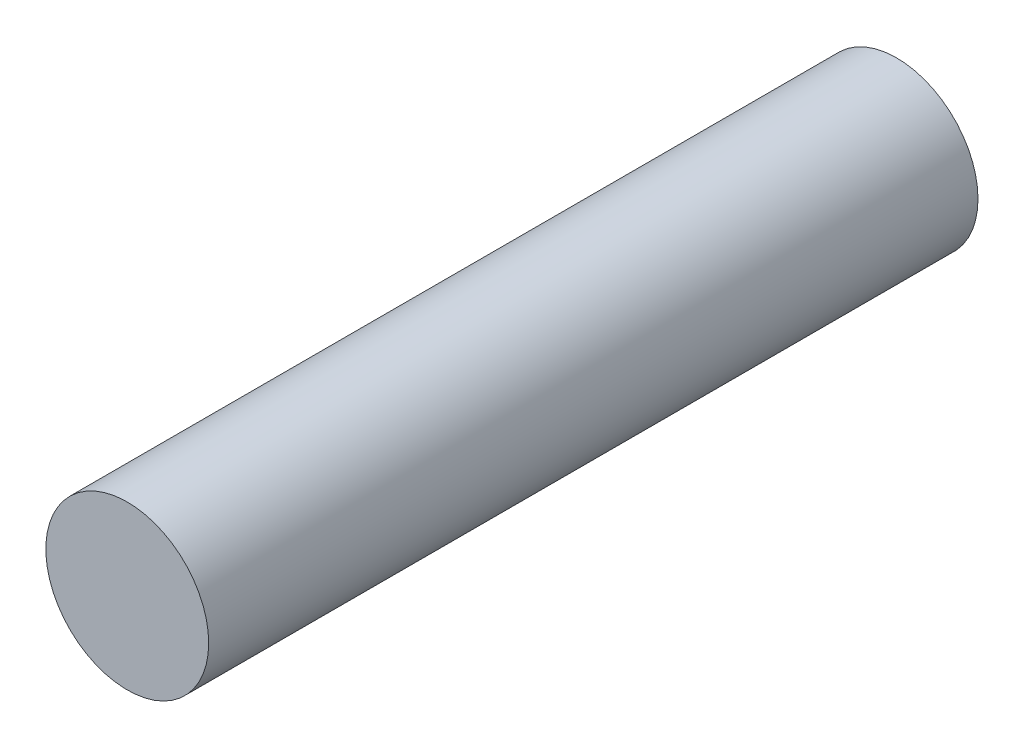
ISO-10303-21;
HEADER;
FILE_DESCRIPTION(('STEP AP214'),'2;1');
FILE_NAME('part.step','',(''),(''),'','','');
FILE_SCHEMA(('AUTOMOTIVE_DESIGN { 1 0 10303 214 1 1 1 1 }'));
ENDSEC;
DATA;
#1=APPLICATION_CONTEXT('core data for automotive mechanical design processes');
#2=APPLICATION_PROTOCOL_DEFINITION('international standard','automotive_design',2000,#1);
#3=PRODUCT_CONTEXT('',#1,'mechanical');
#4=PRODUCT('Part','Part','',(#3));
#5=PRODUCT_RELATED_PRODUCT_CATEGORY('part','',(#4));
#6=PRODUCT_DEFINITION_FORMATION('','',#4);
#7=PRODUCT_DEFINITION_CONTEXT('part definition',#1,'design');
#8=PRODUCT_DEFINITION('design','',#6,#7);
#9=PRODUCT_DEFINITION_SHAPE('','',#8);
#10=(LENGTH_UNIT() NAMED_UNIT(*) SI_UNIT(.MILLI.,.METRE.));
#11=(NAMED_UNIT(*) PLANE_ANGLE_UNIT() SI_UNIT($,.RADIAN.));
#12=(NAMED_UNIT(*) SI_UNIT($,.STERADIAN.) SOLID_ANGLE_UNIT());
#13=UNCERTAINTY_MEASURE_WITH_UNIT(LENGTH_MEASURE(1.E-05),#10,'distance_accuracy_value','');
#14=(GEOMETRIC_REPRESENTATION_CONTEXT(3) GLOBAL_UNCERTAINTY_ASSIGNED_CONTEXT((#13)) GLOBAL_UNIT_ASSIGNED_CONTEXT((#10,
#11,#12)) REPRESENTATION_CONTEXT('',''));
#15=CARTESIAN_POINT('',(0.,0.,0.));
#16=DIRECTION('',(0.,0.,1.));
#17=DIRECTION('',(1.,0.,0.));
#18=AXIS2_PLACEMENT_3D('',#15,#16,#17);
#19=CARTESIAN_POINT('',(0.,0.,-60.));
#20=DIRECTION('',(0.,0.,1.));
#21=DIRECTION('',(1.,0.,0.));
#22=AXIS2_PLACEMENT_3D('',#19,#20,#21);
#23=CYLINDRICAL_SURFACE('',#22,12.7);
#24=CARTESIAN_POINT('',(0.,0.,-60.));
#25=DIRECTION('',(0.,0.,1.));
#26=DIRECTION('',(1.,0.,0.));
#27=AXIS2_PLACEMENT_3D('',#24,#25,#26);
#28=CIRCLE('',#27,12.7);
#29=CARTESIAN_POINT('',(12.7,0.,-60.));
#30=VERTEX_POINT('',#29);
#31=EDGE_CURVE('E10',#30,#30,#28,.T.);
#32=ORIENTED_EDGE('',*,*,#31,.T.);
#33=EDGE_LOOP('',(#32));
#34=FACE_BOUND('',#33,.T.);
#35=CARTESIAN_POINT('',(0.,0.,60.));
#36=DIRECTION('',(0.,0.,1.));
#37=DIRECTION('',(1.,0.,0.));
#38=AXIS2_PLACEMENT_3D('',#35,#36,#37);
#39=CIRCLE('',#38,12.7);
#40=CARTESIAN_POINT('',(12.7,0.,60.));
#41=VERTEX_POINT('',#40);
#42=EDGE_CURVE('E45',#41,#41,#39,.T.);
#43=ORIENTED_EDGE('',*,*,#42,.F.);
#44=EDGE_LOOP('',(#43));
#45=FACE_BOUND('',#44,.T.);
#46=ADVANCED_FACE('F39',(#34,#45),#23,.T.);
#47=CARTESIAN_POINT('',(0.,0.,-60.));
#48=DIRECTION('',(0.,0.,1.));
#49=DIRECTION('',(1.,0.,0.));
#50=AXIS2_PLACEMENT_3D('',#47,#48,#49);
#51=PLANE('',#50);
#52=ORIENTED_EDGE('',*,*,#31,.F.);
#53=EDGE_LOOP('',(#52));
#54=FACE_BOUND('',#53,.T.);
#55=ADVANCED_FACE('F54',(#54),#51,.F.);
#56=CARTESIAN_POINT('',(0.,0.,60.));
#57=DIRECTION('',(0.,0.,1.));
#58=DIRECTION('',(1.,0.,0.));
#59=AXIS2_PLACEMENT_3D('',#56,#57,#58);
#60=PLANE('',#59);
#61=ORIENTED_EDGE('',*,*,#42,.T.);
#62=EDGE_LOOP('',(#61));
#63=FACE_BOUND('',#62,.T.);
#64=ADVANCED_FACE('F51',(#63),#60,.T.);
#65=CLOSED_SHELL('',(#46,#55,#64));
#66=MANIFOLD_SOLID_BREP('B2',#65);
#67=ADVANCED_BREP_SHAPE_REPRESENTATION('',(#18,#66),#14);
#68=SHAPE_DEFINITION_REPRESENTATION(#9,#67);
ENDSEC;
END-ISO-10303-21;
